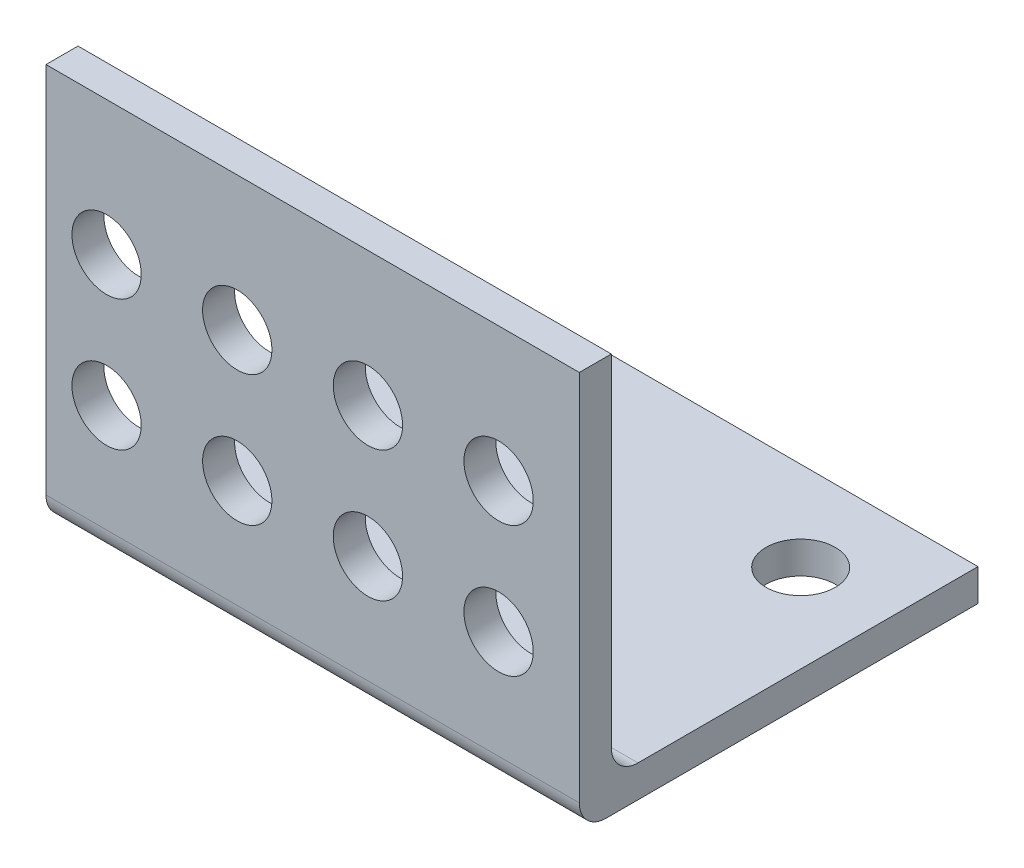
ISO-10303-21;
HEADER;
FILE_DESCRIPTION(('STEP AP214'),'2;1');
FILE_NAME('part.step','',(''),(''),'','','');
FILE_SCHEMA(('AUTOMOTIVE_DESIGN { 1 0 10303 214 1 1 1 1 }'));
ENDSEC;
DATA;
#1=APPLICATION_CONTEXT('core data for automotive mechanical design processes');
#2=APPLICATION_PROTOCOL_DEFINITION('international standard','automotive_design',2000,#1);
#3=PRODUCT_CONTEXT('',#1,'mechanical');
#4=PRODUCT('Part','Part','',(#3));
#5=PRODUCT_RELATED_PRODUCT_CATEGORY('part','',(#4));
#6=PRODUCT_DEFINITION_FORMATION('','',#4);
#7=PRODUCT_DEFINITION_CONTEXT('part definition',#1,'design');
#8=PRODUCT_DEFINITION('design','',#6,#7);
#9=PRODUCT_DEFINITION_SHAPE('','',#8);
#10=(LENGTH_UNIT() NAMED_UNIT(*) SI_UNIT(.MILLI.,.METRE.));
#11=(NAMED_UNIT(*) PLANE_ANGLE_UNIT() SI_UNIT($,.RADIAN.));
#12=(NAMED_UNIT(*) SI_UNIT($,.STERADIAN.) SOLID_ANGLE_UNIT());
#13=UNCERTAINTY_MEASURE_WITH_UNIT(LENGTH_MEASURE(1.E-05),#10,'distance_accuracy_value','');
#14=(GEOMETRIC_REPRESENTATION_CONTEXT(3) GLOBAL_UNCERTAINTY_ASSIGNED_CONTEXT((#13)) GLOBAL_UNIT_ASSIGNED_CONTEXT((#10,
#11,#12)) REPRESENTATION_CONTEXT('',''));
#15=CARTESIAN_POINT('',(0.,0.,0.));
#16=DIRECTION('',(0.,0.,1.));
#17=DIRECTION('',(1.,0.,0.));
#18=AXIS2_PLACEMENT_3D('',#15,#16,#17);
#19=CARTESIAN_POINT('',(-40.,-15.5492167565196,-29.9));
#20=DIRECTION('',(0.,0.,-1.));
#21=DIRECTION('',(-1.,0.,0.));
#22=AXIS2_PLACEMENT_3D('',#19,#20,#21);
#23=PLANE('',#22);
#24=DIRECTION('',(0.,1.,0.));
#25=VECTOR('',#24,1.);
#26=CARTESIAN_POINT('',(0.,-15.5492167565196,-29.9));
#27=LINE('',#26,#25);
#28=CARTESIAN_POINT('',(0.,-17.9492167565196,-29.9));
#29=VERTEX_POINT('',#28);
#30=CARTESIAN_POINT('',(0.,-15.5492167565196,-29.9));
#31=VERTEX_POINT('',#30);
#32=EDGE_CURVE('E131',#29,#31,#27,.T.);
#33=ORIENTED_EDGE('',*,*,#32,.F.);
#34=DIRECTION('',(1.,0.,0.));
#35=VECTOR('',#34,1.);
#36=CARTESIAN_POINT('',(-40.,-17.9492167565196,-29.9));
#37=LINE('',#36,#35);
#38=CARTESIAN_POINT('',(-40.,-17.9492167565196,-29.9));
#39=VERTEX_POINT('',#38);
#40=EDGE_CURVE('E11',#39,#29,#37,.T.);
#41=ORIENTED_EDGE('',*,*,#40,.F.);
#42=DIRECTION('',(0.,1.,0.));
#43=VECTOR('',#42,1.);
#44=CARTESIAN_POINT('',(-40.,-15.5492167565196,-29.9));
#45=LINE('',#44,#43);
#46=CARTESIAN_POINT('',(-40.,-15.5492167565196,-29.9));
#47=VERTEX_POINT('',#46);
#48=EDGE_CURVE('E152',#39,#47,#45,.T.);
#49=ORIENTED_EDGE('',*,*,#48,.T.);
#50=DIRECTION('',(1.,0.,0.));
#51=VECTOR('',#50,1.);
#52=CARTESIAN_POINT('',(-40.,-15.5492167565196,-29.9));
#53=LINE('',#52,#51);
#54=EDGE_CURVE('E89',#47,#31,#53,.T.);
#55=ORIENTED_EDGE('',*,*,#54,.T.);
#56=EDGE_LOOP('',(#33,#41,#49,#55));
#57=FACE_BOUND('',#56,.T.);
#58=ADVANCED_FACE('F33',(#57),#23,.T.);
#59=CARTESIAN_POINT('',(-40.,-17.9492167565196,-2.00000000000001));
#60=DIRECTION('',(0.,-1.,0.));
#61=DIRECTION('',(0.,0.,-1.));
#62=AXIS2_PLACEMENT_3D('',#59,#60,#61);
#63=PLANE('',#62);
#64=CARTESIAN_POINT('',(-6.59999999999999,-17.9492167565196,-23.2));
#65=DIRECTION('',(0.,-1.,0.));
#66=DIRECTION('',(0.,0.,-1.));
#67=AXIS2_PLACEMENT_3D('',#64,#65,#66);
#68=CIRCLE('',#67,2.6);
#69=CARTESIAN_POINT('',(-6.59999999999999,-17.9492167565196,-25.8));
#70=VERTEX_POINT('',#69);
#71=EDGE_CURVE('E279',#70,#70,#68,.T.);
#72=ORIENTED_EDGE('',*,*,#71,.F.);
#73=EDGE_LOOP('',(#72));
#74=FACE_BOUND('',#73,.T.);
#75=CARTESIAN_POINT('',(-33.4,-17.9492167565196,-23.2));
#76=DIRECTION('',(0.,-1.,0.));
#77=DIRECTION('',(0.,0.,-1.));
#78=AXIS2_PLACEMENT_3D('',#75,#76,#77);
#79=CIRCLE('',#78,2.6);
#80=CARTESIAN_POINT('',(-33.4,-17.9492167565196,-25.8));
#81=VERTEX_POINT('',#80);
#82=EDGE_CURVE('E272',#81,#81,#79,.T.);
#83=ORIENTED_EDGE('',*,*,#82,.F.);
#84=EDGE_LOOP('',(#83));
#85=FACE_BOUND('',#84,.T.);
#86=CARTESIAN_POINT('',(-20.,-17.9492167565196,-13.2));
#87=DIRECTION('',(0.,-1.,0.));
#88=DIRECTION('',(0.,0.,-1.));
#89=AXIS2_PLACEMENT_3D('',#86,#87,#88);
#90=CIRCLE('',#89,2.6);
#91=CARTESIAN_POINT('',(-20.,-17.9492167565196,-15.8));
#92=VERTEX_POINT('',#91);
#93=EDGE_CURVE('E271',#92,#92,#90,.T.);
#94=ORIENTED_EDGE('',*,*,#93,.F.);
#95=EDGE_LOOP('',(#94));
#96=FACE_BOUND('',#95,.T.);
#97=DIRECTION('',(0.,0.,-1.));
#98=VECTOR('',#97,1.);
#99=CARTESIAN_POINT('',(0.,-17.9492167565196,-2.00000000000001));
#100=LINE('',#99,#98);
#101=CARTESIAN_POINT('',(0.,-17.9492167565196,-2.00000000000001));
#102=VERTEX_POINT('',#101);
#103=EDGE_CURVE('E150',#102,#29,#100,.T.);
#104=ORIENTED_EDGE('',*,*,#103,.F.);
#105=DIRECTION('',(1.,0.,0.));
#106=VECTOR('',#105,1.);
#107=CARTESIAN_POINT('',(-40.,-17.9492167565196,-2.00000000000001));
#108=LINE('',#107,#106);
#109=CARTESIAN_POINT('',(-40.,-17.9492167565196,-2.00000000000001));
#110=VERTEX_POINT('',#109);
#111=EDGE_CURVE('E42',#110,#102,#108,.T.);
#112=ORIENTED_EDGE('',*,*,#111,.F.);
#113=DIRECTION('',(0.,0.,-1.));
#114=VECTOR('',#113,1.);
#115=CARTESIAN_POINT('',(-40.,-17.9492167565196,-2.00000000000001));
#116=LINE('',#115,#114);
#117=EDGE_CURVE('E121',#110,#39,#116,.T.);
#118=ORIENTED_EDGE('',*,*,#117,.T.);
#119=ORIENTED_EDGE('',*,*,#40,.T.);
#120=EDGE_LOOP('',(#104,#112,#118,#119));
#121=FACE_BOUND('',#120,.T.);
#122=ADVANCED_FACE('F229',(#74,#85,#96,#121),#63,.T.);
#123=CARTESIAN_POINT('',(-40.,-15.9492167565196,-2.));
#124=DIRECTION('',(1.,0.,0.));
#125=DIRECTION('',(0.,0.,-1.));
#126=AXIS2_PLACEMENT_3D('',#123,#124,#125);
#127=CYLINDRICAL_SURFACE('',#126,2.);
#128=CARTESIAN_POINT('',(0.,-15.9492167565196,-2.));
#129=DIRECTION('',(1.,0.,0.));
#130=DIRECTION('',(0.,0.,-1.));
#131=AXIS2_PLACEMENT_3D('',#128,#129,#130);
#132=CIRCLE('',#131,2.);
#133=CARTESIAN_POINT('',(0.,-15.9492167565196,0.));
#134=VERTEX_POINT('',#133);
#135=EDGE_CURVE('E108',#134,#102,#132,.T.);
#136=ORIENTED_EDGE('',*,*,#135,.F.);
#137=DIRECTION('',(1.,0.,0.));
#138=VECTOR('',#137,1.);
#139=CARTESIAN_POINT('',(-40.,-15.9492167565196,0.));
#140=LINE('',#139,#138);
#141=CARTESIAN_POINT('',(-40.,-15.9492167565196,0.));
#142=VERTEX_POINT('',#141);
#143=EDGE_CURVE('E103',#142,#134,#140,.T.);
#144=ORIENTED_EDGE('',*,*,#143,.F.);
#145=CARTESIAN_POINT('',(-40.,-15.9492167565196,-2.));
#146=DIRECTION('',(1.,0.,0.));
#147=DIRECTION('',(0.,0.,-1.));
#148=AXIS2_PLACEMENT_3D('',#145,#146,#147);
#149=CIRCLE('',#148,2.);
#150=EDGE_CURVE('E106',#142,#110,#149,.T.);
#151=ORIENTED_EDGE('',*,*,#150,.T.);
#152=ORIENTED_EDGE('',*,*,#111,.T.);
#153=EDGE_LOOP('',(#136,#144,#151,#152));
#154=FACE_BOUND('',#153,.T.);
#155=ADVANCED_FACE('F105',(#154),#127,.T.);
#156=CARTESIAN_POINT('',(-40.,12.0107832434804,0.));
#157=DIRECTION('',(0.,0.,1.));
#158=DIRECTION('',(1.,0.,0.));
#159=AXIS2_PLACEMENT_3D('',#156,#157,#158);
#160=PLANE('',#159);
#161=CARTESIAN_POINT('',(-35.4557993480049,-7.85921675651958,0.));
#162=DIRECTION('',(0.,0.,-1.));
#163=DIRECTION('',(-1.,0.,0.));
#164=AXIS2_PLACEMENT_3D('',#161,#162,#163);
#165=CIRCLE('',#164,2.6);
#166=CARTESIAN_POINT('',(-38.0557993480049,-7.85921675651958,0.));
#167=VERTEX_POINT('',#166);
#168=EDGE_CURVE('E197',#167,#167,#165,.T.);
#169=ORIENTED_EDGE('',*,*,#168,.T.);
#170=EDGE_LOOP('',(#169));
#171=FACE_BOUND('',#170,.T.);
#172=CARTESIAN_POINT('',(-15.855799348005,1.94078324348042,0.));
#173=DIRECTION('',(0.,0.,1.));
#174=DIRECTION('',(1.,0.,0.));
#175=AXIS2_PLACEMENT_3D('',#172,#173,#174);
#176=CIRCLE('',#175,2.6);
#177=CARTESIAN_POINT('',(-13.255799348005,1.94078324348042,0.));
#178=VERTEX_POINT('',#177);
#179=EDGE_CURVE('E187',#178,#178,#176,.T.);
#180=ORIENTED_EDGE('',*,*,#179,.F.);
#181=EDGE_LOOP('',(#180));
#182=FACE_BOUND('',#181,.T.);
#183=CARTESIAN_POINT('',(-6.05579934800496,1.94078324348042,0.));
#184=DIRECTION('',(0.,0.,1.));
#185=DIRECTION('',(1.,0.,0.));
#186=AXIS2_PLACEMENT_3D('',#183,#184,#185);
#187=CIRCLE('',#186,2.6);
#188=CARTESIAN_POINT('',(-3.45579934800496,1.94078324348042,0.));
#189=VERTEX_POINT('',#188);
#190=EDGE_CURVE('E184',#189,#189,#187,.T.);
#191=ORIENTED_EDGE('',*,*,#190,.F.);
#192=EDGE_LOOP('',(#191));
#193=FACE_BOUND('',#192,.T.);
#194=CARTESIAN_POINT('',(-6.05579934800496,-7.85921675651958,0.));
#195=DIRECTION('',(0.,0.,-1.));
#196=DIRECTION('',(-1.,0.,0.));
#197=AXIS2_PLACEMENT_3D('',#194,#195,#196);
#198=CIRCLE('',#197,2.6);
#199=CARTESIAN_POINT('',(-8.65579934800496,-7.85921675651958,0.));
#200=VERTEX_POINT('',#199);
#201=EDGE_CURVE('E181',#200,#200,#198,.T.);
#202=ORIENTED_EDGE('',*,*,#201,.T.);
#203=EDGE_LOOP('',(#202));
#204=FACE_BOUND('',#203,.T.);
#205=CARTESIAN_POINT('',(-15.855799348005,-7.85921675651958,0.));
#206=DIRECTION('',(0.,0.,-1.));
#207=DIRECTION('',(-1.,0.,0.));
#208=AXIS2_PLACEMENT_3D('',#205,#206,#207);
#209=CIRCLE('',#208,2.6);
#210=CARTESIAN_POINT('',(-18.455799348005,-7.85921675651958,0.));
#211=VERTEX_POINT('',#210);
#212=EDGE_CURVE('E177',#211,#211,#209,.T.);
#213=ORIENTED_EDGE('',*,*,#212,.T.);
#214=EDGE_LOOP('',(#213));
#215=FACE_BOUND('',#214,.T.);
#216=CARTESIAN_POINT('',(-25.655799348005,-7.85921675651958,0.));
#217=DIRECTION('',(0.,0.,-1.));
#218=DIRECTION('',(-1.,0.,0.));
#219=AXIS2_PLACEMENT_3D('',#216,#217,#218);
#220=CIRCLE('',#219,2.6);
#221=CARTESIAN_POINT('',(-28.2557993480049,-7.85921675651958,0.));
#222=VERTEX_POINT('',#221);
#223=EDGE_CURVE('E173',#222,#222,#220,.T.);
#224=ORIENTED_EDGE('',*,*,#223,.T.);
#225=EDGE_LOOP('',(#224));
#226=FACE_BOUND('',#225,.T.);
#227=CARTESIAN_POINT('',(-35.4557993480049,1.94078324348042,0.));
#228=DIRECTION('',(0.,0.,1.));
#229=DIRECTION('',(1.,0.,0.));
#230=AXIS2_PLACEMENT_3D('',#227,#228,#229);
#231=CIRCLE('',#230,2.6);
#232=CARTESIAN_POINT('',(-32.855799348005,1.94078324348042,0.));
#233=VERTEX_POINT('',#232);
#234=EDGE_CURVE('E169',#233,#233,#231,.T.);
#235=ORIENTED_EDGE('',*,*,#234,.F.);
#236=EDGE_LOOP('',(#235));
#237=FACE_BOUND('',#236,.T.);
#238=CARTESIAN_POINT('',(-25.655799348005,1.94078324348042,0.));
#239=DIRECTION('',(0.,0.,1.));
#240=DIRECTION('',(1.,0.,0.));
#241=AXIS2_PLACEMENT_3D('',#238,#239,#240);
#242=CIRCLE('',#241,2.6);
#243=CARTESIAN_POINT('',(-23.055799348005,1.94078324348042,0.));
#244=VERTEX_POINT('',#243);
#245=EDGE_CURVE('E165',#244,#244,#242,.T.);
#246=ORIENTED_EDGE('',*,*,#245,.F.);
#247=EDGE_LOOP('',(#246));
#248=FACE_BOUND('',#247,.T.);
#249=DIRECTION('',(0.,-1.,0.));
#250=VECTOR('',#249,1.);
#251=CARTESIAN_POINT('',(0.,12.0107832434804,0.));
#252=LINE('',#251,#250);
#253=CARTESIAN_POINT('',(0.,12.0107832434804,0.));
#254=VERTEX_POINT('',#253);
#255=EDGE_CURVE('E147',#254,#134,#252,.T.);
#256=ORIENTED_EDGE('',*,*,#255,.F.);
#257=DIRECTION('',(1.,0.,0.));
#258=VECTOR('',#257,1.);
#259=CARTESIAN_POINT('',(-40.,12.0107832434804,0.));
#260=LINE('',#259,#258);
#261=CARTESIAN_POINT('',(-40.,12.0107832434804,0.));
#262=VERTEX_POINT('',#261);
#263=EDGE_CURVE('E113',#262,#254,#260,.T.);
#264=ORIENTED_EDGE('',*,*,#263,.F.);
#265=DIRECTION('',(0.,-1.,0.));
#266=VECTOR('',#265,1.);
#267=CARTESIAN_POINT('',(-40.,12.0107832434804,0.));
#268=LINE('',#267,#266);
#269=EDGE_CURVE('E119',#262,#142,#268,.T.);
#270=ORIENTED_EDGE('',*,*,#269,.T.);
#271=ORIENTED_EDGE('',*,*,#143,.T.);
#272=EDGE_LOOP('',(#256,#264,#270,#271));
#273=FACE_BOUND('',#272,.T.);
#274=ADVANCED_FACE('F123',(#171,#182,#193,#204,#215,#226,#237,#248,#273),#160,.T.);
#275=CARTESIAN_POINT('',(-40.,12.0107832434804,0.));
#276=DIRECTION('',(0.,1.,0.));
#277=DIRECTION('',(0.,0.,1.));
#278=AXIS2_PLACEMENT_3D('',#275,#276,#277);
#279=PLANE('',#278);
#280=DIRECTION('',(0.,0.,1.));
#281=VECTOR('',#280,1.);
#282=CARTESIAN_POINT('',(0.,12.0107832434804,0.));
#283=LINE('',#282,#281);
#284=CARTESIAN_POINT('',(0.,12.0107832434804,-2.4));
#285=VERTEX_POINT('',#284);
#286=EDGE_CURVE('E144',#285,#254,#283,.T.);
#287=ORIENTED_EDGE('',*,*,#286,.F.);
#288=DIRECTION('',(1.,0.,0.));
#289=VECTOR('',#288,1.);
#290=CARTESIAN_POINT('',(-40.,12.0107832434804,-2.4));
#291=LINE('',#290,#289);
#292=CARTESIAN_POINT('',(-40.,12.0107832434804,-2.4));
#293=VERTEX_POINT('',#292);
#294=EDGE_CURVE('E156',#293,#285,#291,.T.);
#295=ORIENTED_EDGE('',*,*,#294,.F.);
#296=DIRECTION('',(0.,0.,1.));
#297=VECTOR('',#296,1.);
#298=CARTESIAN_POINT('',(-40.,12.0107832434804,0.));
#299=LINE('',#298,#297);
#300=EDGE_CURVE('E124',#293,#262,#299,.T.);
#301=ORIENTED_EDGE('',*,*,#300,.T.);
#302=ORIENTED_EDGE('',*,*,#263,.T.);
#303=EDGE_LOOP('',(#287,#295,#301,#302));
#304=FACE_BOUND('',#303,.T.);
#305=ADVANCED_FACE('F245',(#304),#279,.T.);
#306=CARTESIAN_POINT('',(-40.,12.0107832434804,-2.4));
#307=DIRECTION('',(0.,0.,-1.));
#308=DIRECTION('',(-1.,0.,0.));
#309=AXIS2_PLACEMENT_3D('',#306,#307,#308);
#310=PLANE('',#309);
#311=CARTESIAN_POINT('',(-35.4557993480049,-7.85921675651958,-2.4));
#312=DIRECTION('',(0.,0.,-1.));
#313=DIRECTION('',(-1.,0.,0.));
#314=AXIS2_PLACEMENT_3D('',#311,#312,#313);
#315=CIRCLE('',#314,2.6);
#316=CARTESIAN_POINT('',(-38.0557993480049,-7.85921675651958,-2.4));
#317=VERTEX_POINT('',#316);
#318=EDGE_CURVE('E36',#317,#317,#315,.F.);
#319=ORIENTED_EDGE('',*,*,#318,.T.);
#320=EDGE_LOOP('',(#319));
#321=FACE_BOUND('',#320,.T.);
#322=CARTESIAN_POINT('',(-15.855799348005,1.94078324348042,-2.4));
#323=DIRECTION('',(0.,0.,-1.));
#324=DIRECTION('',(-1.,0.,0.));
#325=AXIS2_PLACEMENT_3D('',#322,#323,#324);
#326=CIRCLE('',#325,2.6);
#327=CARTESIAN_POINT('',(-18.455799348005,1.94078324348042,-2.4));
#328=VERTEX_POINT('',#327);
#329=EDGE_CURVE('E185',#328,#328,#326,.T.);
#330=ORIENTED_EDGE('',*,*,#329,.F.);
#331=EDGE_LOOP('',(#330));
#332=FACE_BOUND('',#331,.T.);
#333=CARTESIAN_POINT('',(-6.05579934800496,1.94078324348042,-2.4));
#334=DIRECTION('',(0.,0.,-1.));
#335=DIRECTION('',(-1.,0.,0.));
#336=AXIS2_PLACEMENT_3D('',#333,#334,#335);
#337=CIRCLE('',#336,2.6);
#338=CARTESIAN_POINT('',(-8.65579934800496,1.94078324348042,-2.4));
#339=VERTEX_POINT('',#338);
#340=EDGE_CURVE('E182',#339,#339,#337,.T.);
#341=ORIENTED_EDGE('',*,*,#340,.F.);
#342=EDGE_LOOP('',(#341));
#343=FACE_BOUND('',#342,.T.);
#344=CARTESIAN_POINT('',(-6.05579934800496,-7.85921675651958,-2.4));
#345=DIRECTION('',(0.,0.,-1.));
#346=DIRECTION('',(-1.,0.,0.));
#347=AXIS2_PLACEMENT_3D('',#344,#345,#346);
#348=CIRCLE('',#347,2.6);
#349=CARTESIAN_POINT('',(-8.65579934800496,-7.85921675651958,-2.4));
#350=VERTEX_POINT('',#349);
#351=EDGE_CURVE('E178',#350,#350,#348,.F.);
#352=ORIENTED_EDGE('',*,*,#351,.T.);
#353=EDGE_LOOP('',(#352));
#354=FACE_BOUND('',#353,.T.);
#355=CARTESIAN_POINT('',(-15.855799348005,-7.85921675651958,-2.4));
#356=DIRECTION('',(0.,0.,-1.));
#357=DIRECTION('',(-1.,0.,0.));
#358=AXIS2_PLACEMENT_3D('',#355,#356,#357);
#359=CIRCLE('',#358,2.6);
#360=CARTESIAN_POINT('',(-18.455799348005,-7.85921675651958,-2.4));
#361=VERTEX_POINT('',#360);
#362=EDGE_CURVE('E174',#361,#361,#359,.F.);
#363=ORIENTED_EDGE('',*,*,#362,.T.);
#364=EDGE_LOOP('',(#363));
#365=FACE_BOUND('',#364,.T.);
#366=CARTESIAN_POINT('',(-25.655799348005,-7.85921675651958,-2.4));
#367=DIRECTION('',(0.,0.,-1.));
#368=DIRECTION('',(-1.,0.,0.));
#369=AXIS2_PLACEMENT_3D('',#366,#367,#368);
#370=CIRCLE('',#369,2.6);
#371=CARTESIAN_POINT('',(-28.2557993480049,-7.85921675651958,-2.4));
#372=VERTEX_POINT('',#371);
#373=EDGE_CURVE('E170',#372,#372,#370,.F.);
#374=ORIENTED_EDGE('',*,*,#373,.T.);
#375=EDGE_LOOP('',(#374));
#376=FACE_BOUND('',#375,.T.);
#377=CARTESIAN_POINT('',(-35.4557993480049,1.94078324348042,-2.4));
#378=DIRECTION('',(0.,0.,-1.));
#379=DIRECTION('',(-1.,0.,0.));
#380=AXIS2_PLACEMENT_3D('',#377,#378,#379);
#381=CIRCLE('',#380,2.6);
#382=CARTESIAN_POINT('',(-38.0557993480049,1.94078324348042,-2.4));
#383=VERTEX_POINT('',#382);
#384=EDGE_CURVE('E166',#383,#383,#381,.T.);
#385=ORIENTED_EDGE('',*,*,#384,.F.);
#386=EDGE_LOOP('',(#385));
#387=FACE_BOUND('',#386,.T.);
#388=CARTESIAN_POINT('',(-25.655799348005,1.94078324348042,-2.4));
#389=DIRECTION('',(0.,0.,-1.));
#390=DIRECTION('',(-1.,0.,0.));
#391=AXIS2_PLACEMENT_3D('',#388,#389,#390);
#392=CIRCLE('',#391,2.6);
#393=CARTESIAN_POINT('',(-28.2557993480049,1.94078324348042,-2.4));
#394=VERTEX_POINT('',#393);
#395=EDGE_CURVE('E135',#394,#394,#392,.T.);
#396=ORIENTED_EDGE('',*,*,#395,.F.);
#397=EDGE_LOOP('',(#396));
#398=FACE_BOUND('',#397,.T.);
#399=DIRECTION('',(0.,1.,0.));
#400=VECTOR('',#399,1.);
#401=CARTESIAN_POINT('',(0.,12.0107832434804,-2.4));
#402=LINE('',#401,#400);
#403=CARTESIAN_POINT('',(0.,-13.5492167565196,-2.4));
#404=VERTEX_POINT('',#403);
#405=EDGE_CURVE('E141',#404,#285,#402,.T.);
#406=ORIENTED_EDGE('',*,*,#405,.F.);
#407=DIRECTION('',(1.,0.,0.));
#408=VECTOR('',#407,1.);
#409=CARTESIAN_POINT('',(-40.,-13.5492167565196,-2.4));
#410=LINE('',#409,#408);
#411=CARTESIAN_POINT('',(-40.,-13.5492167565196,-2.4));
#412=VERTEX_POINT('',#411);
#413=EDGE_CURVE('E158',#412,#404,#410,.T.);
#414=ORIENTED_EDGE('',*,*,#413,.F.);
#415=DIRECTION('',(0.,1.,0.));
#416=VECTOR('',#415,1.);
#417=CARTESIAN_POINT('',(-40.,12.0107832434804,-2.4));
#418=LINE('',#417,#416);
#419=EDGE_CURVE('E126',#412,#293,#418,.T.);
#420=ORIENTED_EDGE('',*,*,#419,.T.);
#421=ORIENTED_EDGE('',*,*,#294,.T.);
#422=EDGE_LOOP('',(#406,#414,#420,#421));
#423=FACE_BOUND('',#422,.T.);
#424=ADVANCED_FACE('F220',(#321,#332,#343,#354,#365,#376,#387,#398,#423),#310,.T.);
#425=CARTESIAN_POINT('',(-40.,-13.5492167565196,-4.4));
#426=DIRECTION('',(1.,0.,0.));
#427=DIRECTION('',(0.,0.,-1.));
#428=AXIS2_PLACEMENT_3D('',#425,#426,#427);
#429=CYLINDRICAL_SURFACE('',#428,2.);
#430=CARTESIAN_POINT('',(0.,-13.5492167565196,-4.4));
#431=DIRECTION('',(-1.,0.,0.));
#432=DIRECTION('',(0.,0.,-1.));
#433=AXIS2_PLACEMENT_3D('',#430,#431,#432);
#434=CIRCLE('',#433,2.);
#435=CARTESIAN_POINT('',(0.,-15.5492167565196,-4.40000000000001));
#436=VERTEX_POINT('',#435);
#437=EDGE_CURVE('E138',#436,#404,#434,.T.);
#438=ORIENTED_EDGE('',*,*,#437,.F.);
#439=DIRECTION('',(1.,0.,0.));
#440=VECTOR('',#439,1.);
#441=CARTESIAN_POINT('',(-40.,-15.5492167565196,-4.40000000000001));
#442=LINE('',#441,#440);
#443=CARTESIAN_POINT('',(-40.,-15.5492167565196,-4.40000000000001));
#444=VERTEX_POINT('',#443);
#445=EDGE_CURVE('E160',#444,#436,#442,.T.);
#446=ORIENTED_EDGE('',*,*,#445,.F.);
#447=CARTESIAN_POINT('',(-40.,-13.5492167565196,-4.4));
#448=DIRECTION('',(-1.,0.,0.));
#449=DIRECTION('',(0.,0.,-1.));
#450=AXIS2_PLACEMENT_3D('',#447,#448,#449);
#451=CIRCLE('',#450,2.);
#452=EDGE_CURVE('E214',#444,#412,#451,.T.);
#453=ORIENTED_EDGE('',*,*,#452,.T.);
#454=ORIENTED_EDGE('',*,*,#413,.T.);
#455=EDGE_LOOP('',(#438,#446,#453,#454));
#456=FACE_BOUND('',#455,.T.);
#457=ADVANCED_FACE('F225',(#456),#429,.F.);
#458=CARTESIAN_POINT('',(-40.,-15.5492167565196,-4.40000000000001));
#459=DIRECTION('',(0.,1.,0.));
#460=DIRECTION('',(0.,0.,1.));
#461=AXIS2_PLACEMENT_3D('',#458,#459,#460);
#462=PLANE('',#461);
#463=CARTESIAN_POINT('',(-6.59999999999999,-15.5492167565196,-23.2));
#464=DIRECTION('',(0.,1.,0.));
#465=DIRECTION('',(0.,0.,-1.));
#466=AXIS2_PLACEMENT_3D('',#463,#464,#465);
#467=CIRCLE('',#466,2.6);
#468=CARTESIAN_POINT('',(-6.59999999999999,-15.5492167565196,-25.8));
#469=VERTEX_POINT('',#468);
#470=EDGE_CURVE('E262',#469,#469,#467,.T.);
#471=ORIENTED_EDGE('',*,*,#470,.F.);
#472=EDGE_LOOP('',(#471));
#473=FACE_BOUND('',#472,.T.);
#474=CARTESIAN_POINT('',(-33.4,-15.5492167565196,-23.2));
#475=DIRECTION('',(0.,1.,0.));
#476=DIRECTION('',(0.,0.,1.));
#477=AXIS2_PLACEMENT_3D('',#474,#475,#476);
#478=CIRCLE('',#477,2.6);
#479=CARTESIAN_POINT('',(-33.4,-15.5492167565196,-20.6));
#480=VERTEX_POINT('',#479);
#481=EDGE_CURVE('E266',#480,#480,#478,.T.);
#482=ORIENTED_EDGE('',*,*,#481,.F.);
#483=EDGE_LOOP('',(#482));
#484=FACE_BOUND('',#483,.T.);
#485=CARTESIAN_POINT('',(-20.,-15.5492167565196,-13.2));
#486=DIRECTION('',(0.,1.,0.));
#487=DIRECTION('',(0.,0.,1.));
#488=AXIS2_PLACEMENT_3D('',#485,#486,#487);
#489=CIRCLE('',#488,2.6);
#490=CARTESIAN_POINT('',(-20.,-15.5492167565196,-10.6));
#491=VERTEX_POINT('',#490);
#492=EDGE_CURVE('E269',#491,#491,#489,.T.);
#493=ORIENTED_EDGE('',*,*,#492,.F.);
#494=EDGE_LOOP('',(#493));
#495=FACE_BOUND('',#494,.T.);
#496=DIRECTION('',(0.,0.,1.));
#497=VECTOR('',#496,1.);
#498=CARTESIAN_POINT('',(0.,-15.5492167565196,-4.40000000000001));
#499=LINE('',#498,#497);
#500=EDGE_CURVE('E134',#31,#436,#499,.T.);
#501=ORIENTED_EDGE('',*,*,#500,.F.);
#502=ORIENTED_EDGE('',*,*,#54,.F.);
#503=DIRECTION('',(0.,0.,1.));
#504=VECTOR('',#503,1.);
#505=CARTESIAN_POINT('',(-40.,-15.5492167565196,-4.40000000000001));
#506=LINE('',#505,#504);
#507=EDGE_CURVE('E212',#47,#444,#506,.T.);
#508=ORIENTED_EDGE('',*,*,#507,.T.);
#509=ORIENTED_EDGE('',*,*,#445,.T.);
#510=EDGE_LOOP('',(#501,#502,#508,#509));
#511=FACE_BOUND('',#510,.T.);
#512=ADVANCED_FACE('F226',(#473,#484,#495,#511),#462,.T.);
#513=CARTESIAN_POINT('',(-40.,-15.9492167565196,-2.));
#514=DIRECTION('',(1.,0.,0.));
#515=DIRECTION('',(0.,0.,-1.));
#516=AXIS2_PLACEMENT_3D('',#513,#514,#515);
#517=PLANE('',#516);
#518=ORIENTED_EDGE('',*,*,#48,.F.);
#519=ORIENTED_EDGE('',*,*,#117,.F.);
#520=ORIENTED_EDGE('',*,*,#150,.F.);
#521=ORIENTED_EDGE('',*,*,#269,.F.);
#522=ORIENTED_EDGE('',*,*,#300,.F.);
#523=ORIENTED_EDGE('',*,*,#419,.F.);
#524=ORIENTED_EDGE('',*,*,#452,.F.);
#525=ORIENTED_EDGE('',*,*,#507,.F.);
#526=EDGE_LOOP('',(#518,#519,#520,#521,#522,#523,#524,#525));
#527=FACE_BOUND('',#526,.T.);
#528=ADVANCED_FACE('F117',(#527),#517,.F.);
#529=CARTESIAN_POINT('',(0.,-15.9492167565196,-2.));
#530=DIRECTION('',(1.,0.,0.));
#531=DIRECTION('',(0.,0.,-1.));
#532=AXIS2_PLACEMENT_3D('',#529,#530,#531);
#533=PLANE('',#532);
#534=ORIENTED_EDGE('',*,*,#32,.T.);
#535=ORIENTED_EDGE('',*,*,#500,.T.);
#536=ORIENTED_EDGE('',*,*,#437,.T.);
#537=ORIENTED_EDGE('',*,*,#405,.T.);
#538=ORIENTED_EDGE('',*,*,#286,.T.);
#539=ORIENTED_EDGE('',*,*,#255,.T.);
#540=ORIENTED_EDGE('',*,*,#135,.T.);
#541=ORIENTED_EDGE('',*,*,#103,.T.);
#542=EDGE_LOOP('',(#534,#535,#536,#537,#538,#539,#540,#541));
#543=FACE_BOUND('',#542,.T.);
#544=ADVANCED_FACE('F228',(#543),#533,.T.);
#545=CARTESIAN_POINT('',(-25.655799348005,1.94078324348042,-40.));
#546=DIRECTION('',(0.,0.,1.));
#547=DIRECTION('',(1.,0.,0.));
#548=AXIS2_PLACEMENT_3D('',#545,#546,#547);
#549=CYLINDRICAL_SURFACE('',#548,2.6);
#550=ORIENTED_EDGE('',*,*,#395,.T.);
#551=EDGE_LOOP('',(#550));
#552=FACE_BOUND('',#551,.T.);
#553=ORIENTED_EDGE('',*,*,#245,.T.);
#554=EDGE_LOOP('',(#553));
#555=FACE_BOUND('',#554,.T.);
#556=ADVANCED_FACE('F324',(#552,#555),#549,.F.);
#557=CARTESIAN_POINT('',(-35.4557993480049,1.94078324348042,-40.));
#558=DIRECTION('',(0.,0.,1.));
#559=DIRECTION('',(1.,0.,0.));
#560=AXIS2_PLACEMENT_3D('',#557,#558,#559);
#561=CYLINDRICAL_SURFACE('',#560,2.6);
#562=ORIENTED_EDGE('',*,*,#384,.T.);
#563=EDGE_LOOP('',(#562));
#564=FACE_BOUND('',#563,.T.);
#565=ORIENTED_EDGE('',*,*,#234,.T.);
#566=EDGE_LOOP('',(#565));
#567=FACE_BOUND('',#566,.T.);
#568=ADVANCED_FACE('F320',(#564,#567),#561,.F.);
#569=CARTESIAN_POINT('',(-25.655799348005,-7.85921675651958,-40.));
#570=DIRECTION('',(0.,0.,1.));
#571=DIRECTION('',(1.,0.,0.));
#572=AXIS2_PLACEMENT_3D('',#569,#570,#571);
#573=CYLINDRICAL_SURFACE('',#572,2.6);
#574=ORIENTED_EDGE('',*,*,#373,.F.);
#575=EDGE_LOOP('',(#574));
#576=FACE_BOUND('',#575,.T.);
#577=ORIENTED_EDGE('',*,*,#223,.F.);
#578=EDGE_LOOP('',(#577));
#579=FACE_BOUND('',#578,.T.);
#580=ADVANCED_FACE('F316',(#576,#579),#573,.F.);
#581=CARTESIAN_POINT('',(-15.855799348005,-7.85921675651958,-40.));
#582=DIRECTION('',(0.,0.,1.));
#583=DIRECTION('',(1.,0.,0.));
#584=AXIS2_PLACEMENT_3D('',#581,#582,#583);
#585=CYLINDRICAL_SURFACE('',#584,2.6);
#586=ORIENTED_EDGE('',*,*,#362,.F.);
#587=EDGE_LOOP('',(#586));
#588=FACE_BOUND('',#587,.T.);
#589=ORIENTED_EDGE('',*,*,#212,.F.);
#590=EDGE_LOOP('',(#589));
#591=FACE_BOUND('',#590,.T.);
#592=ADVANCED_FACE('F312',(#588,#591),#585,.F.);
#593=CARTESIAN_POINT('',(-6.05579934800496,-7.85921675651958,-40.));
#594=DIRECTION('',(0.,0.,1.));
#595=DIRECTION('',(1.,0.,0.));
#596=AXIS2_PLACEMENT_3D('',#593,#594,#595);
#597=CYLINDRICAL_SURFACE('',#596,2.6);
#598=ORIENTED_EDGE('',*,*,#351,.F.);
#599=EDGE_LOOP('',(#598));
#600=FACE_BOUND('',#599,.T.);
#601=ORIENTED_EDGE('',*,*,#201,.F.);
#602=EDGE_LOOP('',(#601));
#603=FACE_BOUND('',#602,.T.);
#604=ADVANCED_FACE('F308',(#600,#603),#597,.F.);
#605=CARTESIAN_POINT('',(-6.05579934800496,1.94078324348042,-40.));
#606=DIRECTION('',(0.,0.,1.));
#607=DIRECTION('',(1.,0.,0.));
#608=AXIS2_PLACEMENT_3D('',#605,#606,#607);
#609=CYLINDRICAL_SURFACE('',#608,2.6);
#610=ORIENTED_EDGE('',*,*,#340,.T.);
#611=EDGE_LOOP('',(#610));
#612=FACE_BOUND('',#611,.T.);
#613=ORIENTED_EDGE('',*,*,#190,.T.);
#614=EDGE_LOOP('',(#613));
#615=FACE_BOUND('',#614,.T.);
#616=ADVANCED_FACE('F305',(#612,#615),#609,.F.);
#617=CARTESIAN_POINT('',(-15.855799348005,1.94078324348042,-40.));
#618=DIRECTION('',(0.,0.,1.));
#619=DIRECTION('',(1.,0.,0.));
#620=AXIS2_PLACEMENT_3D('',#617,#618,#619);
#621=CYLINDRICAL_SURFACE('',#620,2.6);
#622=ORIENTED_EDGE('',*,*,#329,.T.);
#623=EDGE_LOOP('',(#622));
#624=FACE_BOUND('',#623,.T.);
#625=ORIENTED_EDGE('',*,*,#179,.T.);
#626=EDGE_LOOP('',(#625));
#627=FACE_BOUND('',#626,.T.);
#628=ADVANCED_FACE('F301',(#624,#627),#621,.F.);
#629=CARTESIAN_POINT('',(-35.4557993480049,-7.85921675651958,-40.));
#630=DIRECTION('',(0.,0.,1.));
#631=DIRECTION('',(1.,0.,0.));
#632=AXIS2_PLACEMENT_3D('',#629,#630,#631);
#633=CYLINDRICAL_SURFACE('',#632,2.6);
#634=ORIENTED_EDGE('',*,*,#318,.F.);
#635=EDGE_LOOP('',(#634));
#636=FACE_BOUND('',#635,.T.);
#637=ORIENTED_EDGE('',*,*,#168,.F.);
#638=EDGE_LOOP('',(#637));
#639=FACE_BOUND('',#638,.T.);
#640=ADVANCED_FACE('F297',(#636,#639),#633,.F.);
#641=CARTESIAN_POINT('',(-20.,-55.5492167565196,-13.2));
#642=DIRECTION('',(0.,1.,0.));
#643=DIRECTION('',(0.,0.,1.));
#644=AXIS2_PLACEMENT_3D('',#641,#642,#643);
#645=CYLINDRICAL_SURFACE('',#644,2.6);
#646=ORIENTED_EDGE('',*,*,#93,.T.);
#647=EDGE_LOOP('',(#646));
#648=FACE_BOUND('',#647,.T.);
#649=ORIENTED_EDGE('',*,*,#492,.T.);
#650=EDGE_LOOP('',(#649));
#651=FACE_BOUND('',#650,.T.);
#652=ADVANCED_FACE('F291',(#648,#651),#645,.F.);
#653=CARTESIAN_POINT('',(-33.4,-55.5492167565196,-23.2));
#654=DIRECTION('',(0.,1.,0.));
#655=DIRECTION('',(0.,0.,1.));
#656=AXIS2_PLACEMENT_3D('',#653,#654,#655);
#657=CYLINDRICAL_SURFACE('',#656,2.6);
#658=ORIENTED_EDGE('',*,*,#82,.T.);
#659=EDGE_LOOP('',(#658));
#660=FACE_BOUND('',#659,.T.);
#661=ORIENTED_EDGE('',*,*,#481,.T.);
#662=EDGE_LOOP('',(#661));
#663=FACE_BOUND('',#662,.T.);
#664=ADVANCED_FACE('F285',(#660,#663),#657,.F.);
#665=CARTESIAN_POINT('',(-6.59999999999999,-55.5492167565196,-23.2));
#666=DIRECTION('',(0.,1.,0.));
#667=DIRECTION('',(0.,0.,1.));
#668=AXIS2_PLACEMENT_3D('',#665,#666,#667);
#669=CYLINDRICAL_SURFACE('',#668,2.6);
#670=ORIENTED_EDGE('',*,*,#71,.T.);
#671=EDGE_LOOP('',(#670));
#672=FACE_BOUND('',#671,.T.);
#673=ORIENTED_EDGE('',*,*,#470,.T.);
#674=EDGE_LOOP('',(#673));
#675=FACE_BOUND('',#674,.T.);
#676=ADVANCED_FACE('F283',(#672,#675),#669,.F.);
#677=CLOSED_SHELL('',(#58,#122,#155,#274,#305,#424,#457,#512,#528,#544,#556,#568,#580,#592,#604,
#616,#628,#640,#652,#664,#676));
#678=MANIFOLD_SOLID_BREP('B2',#677);
#679=ADVANCED_BREP_SHAPE_REPRESENTATION('',(#18,#678),#14);
#680=SHAPE_DEFINITION_REPRESENTATION(#9,#679);
ENDSEC;
END-ISO-10303-21;
